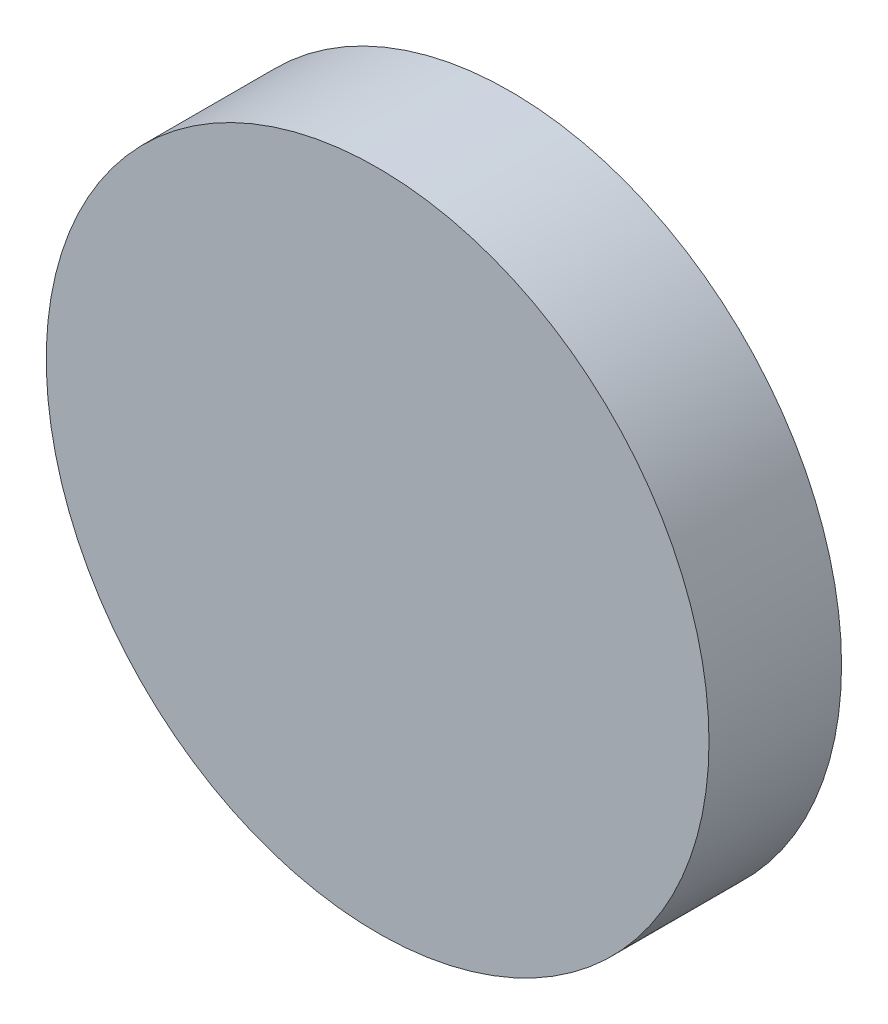
ISO-10303-21;
HEADER;
FILE_DESCRIPTION(('STEP AP214'),'2;1');
FILE_NAME('part.step','',(''),(''),'','','');
FILE_SCHEMA(('AUTOMOTIVE_DESIGN { 1 0 10303 214 1 1 1 1 }'));
ENDSEC;
DATA;
#1=APPLICATION_CONTEXT('core data for automotive mechanical design processes');
#2=APPLICATION_PROTOCOL_DEFINITION('international standard','automotive_design',2000,#1);
#3=PRODUCT_CONTEXT('',#1,'mechanical');
#4=PRODUCT('Part','Part','',(#3));
#5=PRODUCT_RELATED_PRODUCT_CATEGORY('part','',(#4));
#6=PRODUCT_DEFINITION_FORMATION('','',#4);
#7=PRODUCT_DEFINITION_CONTEXT('part definition',#1,'design');
#8=PRODUCT_DEFINITION('design','',#6,#7);
#9=PRODUCT_DEFINITION_SHAPE('','',#8);
#10=(LENGTH_UNIT() NAMED_UNIT(*) SI_UNIT(.MILLI.,.METRE.));
#11=(NAMED_UNIT(*) PLANE_ANGLE_UNIT() SI_UNIT($,.RADIAN.));
#12=(NAMED_UNIT(*) SI_UNIT($,.STERADIAN.) SOLID_ANGLE_UNIT());
#13=UNCERTAINTY_MEASURE_WITH_UNIT(LENGTH_MEASURE(1.E-05),#10,'distance_accuracy_value','');
#14=(GEOMETRIC_REPRESENTATION_CONTEXT(3) GLOBAL_UNCERTAINTY_ASSIGNED_CONTEXT((#13)) GLOBAL_UNIT_ASSIGNED_CONTEXT((#10,
#11,#12)) REPRESENTATION_CONTEXT('',''));
#15=CARTESIAN_POINT('',(0.,0.,0.));
#16=DIRECTION('',(0.,0.,1.));
#17=DIRECTION('',(1.,0.,0.));
#18=AXIS2_PLACEMENT_3D('',#15,#16,#17);
#19=CARTESIAN_POINT('',(0.,0.,2.));
#20=DIRECTION('',(0.,0.,-1.));
#21=DIRECTION('',(-1.,0.,0.));
#22=AXIS2_PLACEMENT_3D('',#19,#20,#21);
#23=CYLINDRICAL_SURFACE('',#22,5.);
#24=CARTESIAN_POINT('',(0.,0.,2.));
#25=DIRECTION('',(0.,0.,1.));
#26=DIRECTION('',(1.,0.,0.));
#27=AXIS2_PLACEMENT_3D('',#24,#25,#26);
#28=CIRCLE('',#27,5.);
#29=CARTESIAN_POINT('',(5.,0.,2.));
#30=VERTEX_POINT('',#29);
#31=EDGE_CURVE('E10',#30,#30,#28,.T.);
#32=ORIENTED_EDGE('',*,*,#31,.F.);
#33=EDGE_LOOP('',(#32));
#34=FACE_BOUND('',#33,.T.);
#35=CARTESIAN_POINT('',(0.,0.,0.));
#36=DIRECTION('',(0.,0.,1.));
#37=DIRECTION('',(1.,0.,0.));
#38=AXIS2_PLACEMENT_3D('',#35,#36,#37);
#39=CIRCLE('',#38,5.);
#40=CARTESIAN_POINT('',(5.,0.,0.));
#41=VERTEX_POINT('',#40);
#42=EDGE_CURVE('E40',#41,#41,#39,.T.);
#43=ORIENTED_EDGE('',*,*,#42,.T.);
#44=EDGE_LOOP('',(#43));
#45=FACE_BOUND('',#44,.T.);
#46=ADVANCED_FACE('F37',(#34,#45),#23,.T.);
#47=CARTESIAN_POINT('',(0.,0.,2.));
#48=DIRECTION('',(0.,0.,1.));
#49=DIRECTION('',(1.,0.,0.));
#50=AXIS2_PLACEMENT_3D('',#47,#48,#49);
#51=PLANE('',#50);
#52=ORIENTED_EDGE('',*,*,#31,.T.);
#53=EDGE_LOOP('',(#52));
#54=FACE_BOUND('',#53,.T.);
#55=ADVANCED_FACE('F66',(#54),#51,.T.);
#56=CARTESIAN_POINT('',(0.,0.,0.));
#57=DIRECTION('',(0.,0.,1.));
#58=DIRECTION('',(1.,0.,0.));
#59=AXIS2_PLACEMENT_3D('',#56,#57,#58);
#60=PLANE('',#59);
#61=CARTESIAN_POINT('',(0.,0.,0.));
#62=DIRECTION('',(0.,0.,-1.));
#63=DIRECTION('',(-1.,0.,0.));
#64=AXIS2_PLACEMENT_3D('',#61,#62,#63);
#65=CIRCLE('',#64,2.);
#66=CARTESIAN_POINT('',(-2.,0.,0.));
#67=VERTEX_POINT('',#66);
#68=EDGE_CURVE('E49',#67,#67,#65,.T.);
#69=ORIENTED_EDGE('',*,*,#68,.F.);
#70=EDGE_LOOP('',(#69));
#71=FACE_BOUND('',#70,.T.);
#72=ORIENTED_EDGE('',*,*,#42,.F.);
#73=EDGE_LOOP('',(#72));
#74=FACE_BOUND('',#73,.T.);
#75=ADVANCED_FACE('F60',(#71,#74),#60,.F.);
#76=CARTESIAN_POINT('',(0.,0.,0.5));
#77=DIRECTION('',(0.,0.,-1.));
#78=DIRECTION('',(-1.,0.,0.));
#79=AXIS2_PLACEMENT_3D('',#76,#77,#78);
#80=CYLINDRICAL_SURFACE('',#79,2.);
#81=CARTESIAN_POINT('',(0.,0.,0.5));
#82=DIRECTION('',(0.,0.,-1.));
#83=DIRECTION('',(-1.,0.,0.));
#84=AXIS2_PLACEMENT_3D('',#81,#82,#83);
#85=CIRCLE('',#84,2.);
#86=CARTESIAN_POINT('',(-2.,0.,0.5));
#87=VERTEX_POINT('',#86);
#88=EDGE_CURVE('E47',#87,#87,#85,.T.);
#89=ORIENTED_EDGE('',*,*,#88,.F.);
#90=EDGE_LOOP('',(#89));
#91=FACE_BOUND('',#90,.T.);
#92=ORIENTED_EDGE('',*,*,#68,.T.);
#93=EDGE_LOOP('',(#92));
#94=FACE_BOUND('',#93,.T.);
#95=ADVANCED_FACE('F57',(#91,#94),#80,.F.);
#96=CARTESIAN_POINT('',(0.,0.,0.5));
#97=DIRECTION('',(0.,0.,-1.));
#98=DIRECTION('',(-1.,0.,0.));
#99=AXIS2_PLACEMENT_3D('',#96,#97,#98);
#100=PLANE('',#99);
#101=ORIENTED_EDGE('',*,*,#88,.T.);
#102=EDGE_LOOP('',(#101));
#103=FACE_BOUND('',#102,.T.);
#104=ADVANCED_FACE('F55',(#103),#100,.T.);
#105=CLOSED_SHELL('',(#46,#55,#75,#95,#104));
#106=MANIFOLD_SOLID_BREP('B2',#105);
#107=ADVANCED_BREP_SHAPE_REPRESENTATION('',(#18,#106),#14);
#108=SHAPE_DEFINITION_REPRESENTATION(#9,#107);
ENDSEC;
END-ISO-10303-21;
